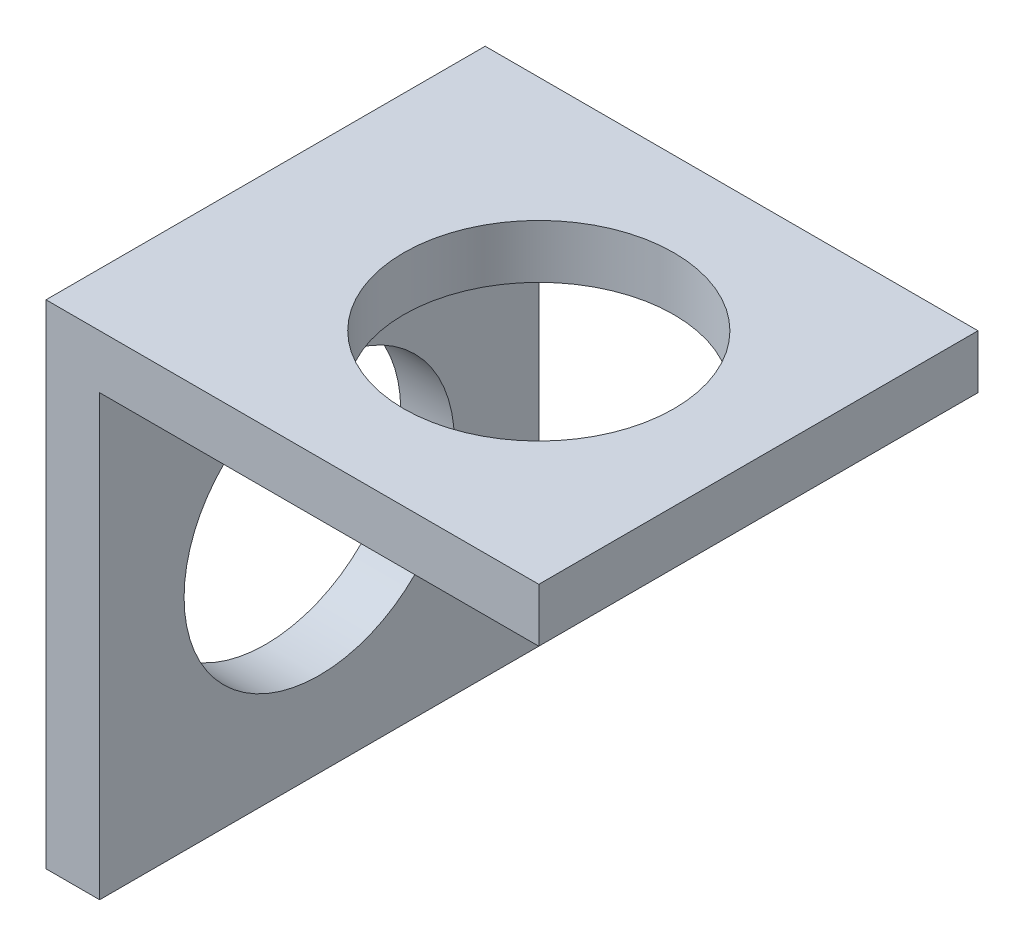
ISO-10303-21;
HEADER;
FILE_DESCRIPTION(('STEP AP214'),'2;1');
FILE_NAME('part.step','',(''),(''),'','','');
FILE_SCHEMA(('AUTOMOTIVE_DESIGN { 1 0 10303 214 1 1 1 1 }'));
ENDSEC;
DATA;
#1=APPLICATION_CONTEXT('core data for automotive mechanical design processes');
#2=APPLICATION_PROTOCOL_DEFINITION('international standard','automotive_design',2000,#1);
#3=PRODUCT_CONTEXT('',#1,'mechanical');
#4=PRODUCT('Part','Part','',(#3));
#5=PRODUCT_RELATED_PRODUCT_CATEGORY('part','',(#4));
#6=PRODUCT_DEFINITION_FORMATION('','',#4);
#7=PRODUCT_DEFINITION_CONTEXT('part definition',#1,'design');
#8=PRODUCT_DEFINITION('design','',#6,#7);
#9=PRODUCT_DEFINITION_SHAPE('','',#8);
#10=(LENGTH_UNIT() NAMED_UNIT(*) SI_UNIT(.MILLI.,.METRE.));
#11=(NAMED_UNIT(*) PLANE_ANGLE_UNIT() SI_UNIT($,.RADIAN.));
#12=(NAMED_UNIT(*) SI_UNIT($,.STERADIAN.) SOLID_ANGLE_UNIT());
#13=UNCERTAINTY_MEASURE_WITH_UNIT(LENGTH_MEASURE(1.E-05),#10,'distance_accuracy_value','');
#14=(GEOMETRIC_REPRESENTATION_CONTEXT(3) GLOBAL_UNCERTAINTY_ASSIGNED_CONTEXT((#13)) GLOBAL_UNIT_ASSIGNED_CONTEXT((#10,
#11,#12)) REPRESENTATION_CONTEXT('',''));
#15=CARTESIAN_POINT('',(0.,0.,0.));
#16=DIRECTION('',(0.,0.,1.));
#17=DIRECTION('',(1.,0.,0.));
#18=AXIS2_PLACEMENT_3D('',#15,#16,#17);
#19=CARTESIAN_POINT('',(0.,0.,52.));
#20=DIRECTION('',(0.,1.,0.));
#21=DIRECTION('',(0.,0.,1.));
#22=AXIS2_PLACEMENT_3D('',#19,#20,#21);
#23=PLANE('',#22);
#24=DIRECTION('',(1.,0.,0.));
#25=VECTOR('',#24,1.);
#26=CARTESIAN_POINT('',(0.,0.,0.));
#27=LINE('',#26,#25);
#28=CARTESIAN_POINT('',(0.,0.,0.));
#29=VERTEX_POINT('',#28);
#30=CARTESIAN_POINT('',(6.35,0.,0.));
#31=VERTEX_POINT('',#30);
#32=EDGE_CURVE('E123',#29,#31,#27,.T.);
#33=ORIENTED_EDGE('',*,*,#32,.T.);
#34=DIRECTION('',(0.,0.,-1.));
#35=VECTOR('',#34,1.);
#36=CARTESIAN_POINT('',(6.35,0.,52.));
#37=LINE('',#36,#35);
#38=CARTESIAN_POINT('',(6.35,0.,52.));
#39=VERTEX_POINT('',#38);
#40=EDGE_CURVE('E42',#39,#31,#37,.T.);
#41=ORIENTED_EDGE('',*,*,#40,.F.);
#42=DIRECTION('',(1.,0.,0.));
#43=VECTOR('',#42,1.);
#44=CARTESIAN_POINT('',(0.,0.,52.));
#45=LINE('',#44,#43);
#46=CARTESIAN_POINT('',(0.,0.,52.));
#47=VERTEX_POINT('',#46);
#48=EDGE_CURVE('E89',#47,#39,#45,.T.);
#49=ORIENTED_EDGE('',*,*,#48,.F.);
#50=DIRECTION('',(0.,0.,-1.));
#51=VECTOR('',#50,1.);
#52=CARTESIAN_POINT('',(0.,0.,52.));
#53=LINE('',#52,#51);
#54=EDGE_CURVE('E11',#47,#29,#53,.T.);
#55=ORIENTED_EDGE('',*,*,#54,.T.);
#56=EDGE_LOOP('',(#33,#41,#49,#55));
#57=FACE_BOUND('',#56,.T.);
#58=ADVANCED_FACE('F33',(#57),#23,.F.);
#59=CARTESIAN_POINT('',(6.35,0.,52.));
#60=DIRECTION('',(-1.,0.,0.));
#61=DIRECTION('',(0.,0.,1.));
#62=AXIS2_PLACEMENT_3D('',#59,#60,#61);
#63=PLANE('',#62);
#64=CARTESIAN_POINT('',(6.35,26.,26.));
#65=DIRECTION('',(1.,0.,0.));
#66=DIRECTION('',(0.,0.,-1.));
#67=AXIS2_PLACEMENT_3D('',#64,#65,#66);
#68=CIRCLE('',#67,16.);
#69=CARTESIAN_POINT('',(6.35,26.,10.));
#70=VERTEX_POINT('',#69);
#71=EDGE_CURVE('E146',#70,#70,#68,.T.);
#72=ORIENTED_EDGE('',*,*,#71,.F.);
#73=EDGE_LOOP('',(#72));
#74=FACE_BOUND('',#73,.T.);
#75=DIRECTION('',(0.,1.,0.));
#76=VECTOR('',#75,1.);
#77=CARTESIAN_POINT('',(6.35,0.,0.));
#78=LINE('',#77,#76);
#79=CARTESIAN_POINT('',(6.35,52.,0.));
#80=VERTEX_POINT('',#79);
#81=EDGE_CURVE('E125',#31,#80,#78,.T.);
#82=ORIENTED_EDGE('',*,*,#81,.T.);
#83=DIRECTION('',(0.,0.,-1.));
#84=VECTOR('',#83,1.);
#85=CARTESIAN_POINT('',(6.35,52.,52.));
#86=LINE('',#85,#84);
#87=CARTESIAN_POINT('',(6.35,52.,52.));
#88=VERTEX_POINT('',#87);
#89=EDGE_CURVE('E112',#88,#80,#86,.T.);
#90=ORIENTED_EDGE('',*,*,#89,.F.);
#91=DIRECTION('',(0.,1.,0.));
#92=VECTOR('',#91,1.);
#93=CARTESIAN_POINT('',(6.35,0.,52.));
#94=LINE('',#93,#92);
#95=EDGE_CURVE('E103',#39,#88,#94,.T.);
#96=ORIENTED_EDGE('',*,*,#95,.F.);
#97=ORIENTED_EDGE('',*,*,#40,.T.);
#98=EDGE_LOOP('',(#82,#90,#96,#97));
#99=FACE_BOUND('',#98,.T.);
#100=ADVANCED_FACE('F153',(#74,#99),#63,.F.);
#101=CARTESIAN_POINT('',(6.35,52.,52.));
#102=DIRECTION('',(0.,1.,0.));
#103=DIRECTION('',(0.,0.,1.));
#104=AXIS2_PLACEMENT_3D('',#101,#102,#103);
#105=PLANE('',#104);
#106=CARTESIAN_POINT('',(32.35,52.,26.));
#107=DIRECTION('',(0.,-1.,0.));
#108=DIRECTION('',(0.,0.,-1.));
#109=AXIS2_PLACEMENT_3D('',#106,#107,#108);
#110=CIRCLE('',#109,16.);
#111=CARTESIAN_POINT('',(32.35,52.,10.));
#112=VERTEX_POINT('',#111);
#113=EDGE_CURVE('E138',#112,#112,#110,.T.);
#114=ORIENTED_EDGE('',*,*,#113,.F.);
#115=EDGE_LOOP('',(#114));
#116=FACE_BOUND('',#115,.T.);
#117=DIRECTION('',(1.,0.,0.));
#118=VECTOR('',#117,1.);
#119=CARTESIAN_POINT('',(6.35,52.,0.));
#120=LINE('',#119,#118);
#121=CARTESIAN_POINT('',(58.35,52.,0.));
#122=VERTEX_POINT('',#121);
#123=EDGE_CURVE('E111',#80,#122,#120,.T.);
#124=ORIENTED_EDGE('',*,*,#123,.T.);
#125=DIRECTION('',(0.,0.,-1.));
#126=VECTOR('',#125,1.);
#127=CARTESIAN_POINT('',(58.35,52.,52.));
#128=LINE('',#127,#126);
#129=CARTESIAN_POINT('',(58.35,52.,52.));
#130=VERTEX_POINT('',#129);
#131=EDGE_CURVE('E108',#130,#122,#128,.T.);
#132=ORIENTED_EDGE('',*,*,#131,.F.);
#133=DIRECTION('',(1.,0.,0.));
#134=VECTOR('',#133,1.);
#135=CARTESIAN_POINT('',(6.35,52.,52.));
#136=LINE('',#135,#134);
#137=EDGE_CURVE('E97',#88,#130,#136,.T.);
#138=ORIENTED_EDGE('',*,*,#137,.F.);
#139=ORIENTED_EDGE('',*,*,#89,.T.);
#140=EDGE_LOOP('',(#124,#132,#138,#139));
#141=FACE_BOUND('',#140,.T.);
#142=ADVANCED_FACE('F109',(#116,#141),#105,.F.);
#143=CARTESIAN_POINT('',(58.35,52.,52.));
#144=DIRECTION('',(-1.,0.,0.));
#145=DIRECTION('',(0.,0.,1.));
#146=AXIS2_PLACEMENT_3D('',#143,#144,#145);
#147=PLANE('',#146);
#148=DIRECTION('',(0.,1.,0.));
#149=VECTOR('',#148,1.);
#150=CARTESIAN_POINT('',(58.35,52.,0.));
#151=LINE('',#150,#149);
#152=CARTESIAN_POINT('',(58.35,58.35,0.));
#153=VERTEX_POINT('',#152);
#154=EDGE_CURVE('E75',#122,#153,#151,.T.);
#155=ORIENTED_EDGE('',*,*,#154,.T.);
#156=DIRECTION('',(0.,0.,-1.));
#157=VECTOR('',#156,1.);
#158=CARTESIAN_POINT('',(58.35,58.35,52.));
#159=LINE('',#158,#157);
#160=CARTESIAN_POINT('',(58.35,58.35,52.));
#161=VERTEX_POINT('',#160);
#162=EDGE_CURVE('E113',#161,#153,#159,.T.);
#163=ORIENTED_EDGE('',*,*,#162,.F.);
#164=DIRECTION('',(0.,1.,0.));
#165=VECTOR('',#164,1.);
#166=CARTESIAN_POINT('',(58.35,52.,52.));
#167=LINE('',#166,#165);
#168=EDGE_CURVE('E101',#130,#161,#167,.T.);
#169=ORIENTED_EDGE('',*,*,#168,.F.);
#170=ORIENTED_EDGE('',*,*,#131,.T.);
#171=EDGE_LOOP('',(#155,#163,#169,#170));
#172=FACE_BOUND('',#171,.T.);
#173=ADVANCED_FACE('F115',(#172),#147,.F.);
#174=CARTESIAN_POINT('',(0.,58.35,52.));
#175=DIRECTION('',(0.,-1.,0.));
#176=DIRECTION('',(0.,0.,-1.));
#177=AXIS2_PLACEMENT_3D('',#174,#175,#176);
#178=PLANE('',#177);
#179=CARTESIAN_POINT('',(32.35,58.35,26.));
#180=DIRECTION('',(0.,-1.,0.));
#181=DIRECTION('',(0.,0.,-1.));
#182=AXIS2_PLACEMENT_3D('',#179,#180,#181);
#183=CIRCLE('',#182,16.);
#184=CARTESIAN_POINT('',(32.35,58.35,10.));
#185=VERTEX_POINT('',#184);
#186=EDGE_CURVE('E126',#185,#185,#183,.T.);
#187=ORIENTED_EDGE('',*,*,#186,.T.);
#188=EDGE_LOOP('',(#187));
#189=FACE_BOUND('',#188,.T.);
#190=DIRECTION('',(-1.,0.,0.));
#191=VECTOR('',#190,1.);
#192=CARTESIAN_POINT('',(0.,58.35,0.));
#193=LINE('',#192,#191);
#194=CARTESIAN_POINT('',(0.,58.35,0.));
#195=VERTEX_POINT('',#194);
#196=EDGE_CURVE('E82',#153,#195,#193,.T.);
#197=ORIENTED_EDGE('',*,*,#196,.T.);
#198=DIRECTION('',(0.,0.,-1.));
#199=VECTOR('',#198,1.);
#200=CARTESIAN_POINT('',(0.,58.35,52.));
#201=LINE('',#200,#199);
#202=CARTESIAN_POINT('',(0.,58.35,52.));
#203=VERTEX_POINT('',#202);
#204=EDGE_CURVE('E119',#203,#195,#201,.T.);
#205=ORIENTED_EDGE('',*,*,#204,.F.);
#206=DIRECTION('',(-1.,0.,0.));
#207=VECTOR('',#206,1.);
#208=CARTESIAN_POINT('',(0.,58.35,52.));
#209=LINE('',#208,#207);
#210=EDGE_CURVE('E117',#161,#203,#209,.T.);
#211=ORIENTED_EDGE('',*,*,#210,.F.);
#212=ORIENTED_EDGE('',*,*,#162,.T.);
#213=EDGE_LOOP('',(#197,#205,#211,#212));
#214=FACE_BOUND('',#213,.T.);
#215=ADVANCED_FACE('F158',(#189,#214),#178,.F.);
#216=CARTESIAN_POINT('',(0.,32.9730805379301,52.));
#217=DIRECTION('',(1.,0.,0.));
#218=DIRECTION('',(0.,0.,-1.));
#219=AXIS2_PLACEMENT_3D('',#216,#217,#218);
#220=PLANE('',#219);
#221=CARTESIAN_POINT('',(0.,26.,26.));
#222=DIRECTION('',(1.,0.,0.));
#223=DIRECTION('',(0.,0.,-1.));
#224=AXIS2_PLACEMENT_3D('',#221,#222,#223);
#225=CIRCLE('',#224,16.);
#226=CARTESIAN_POINT('',(0.,26.,10.));
#227=VERTEX_POINT('',#226);
#228=EDGE_CURVE('E36',#227,#227,#225,.T.);
#229=ORIENTED_EDGE('',*,*,#228,.T.);
#230=EDGE_LOOP('',(#229));
#231=FACE_BOUND('',#230,.T.);
#232=DIRECTION('',(0.,-1.,0.));
#233=VECTOR('',#232,1.);
#234=CARTESIAN_POINT('',(0.,32.9730805379301,0.));
#235=LINE('',#234,#233);
#236=EDGE_CURVE('E131',#195,#29,#235,.T.);
#237=ORIENTED_EDGE('',*,*,#236,.T.);
#238=ORIENTED_EDGE('',*,*,#54,.F.);
#239=DIRECTION('',(0.,-1.,0.));
#240=VECTOR('',#239,1.);
#241=CARTESIAN_POINT('',(0.,0.,52.));
#242=LINE('',#241,#240);
#243=EDGE_CURVE('E51',#203,#47,#242,.T.);
#244=ORIENTED_EDGE('',*,*,#243,.F.);
#245=ORIENTED_EDGE('',*,*,#204,.T.);
#246=EDGE_LOOP('',(#237,#238,#244,#245));
#247=FACE_BOUND('',#246,.T.);
#248=ADVANCED_FACE('F157',(#231,#247),#220,.F.);
#249=CARTESIAN_POINT('',(0.,0.,52.));
#250=DIRECTION('',(0.,0.,-1.));
#251=DIRECTION('',(-1.,0.,0.));
#252=AXIS2_PLACEMENT_3D('',#249,#250,#251);
#253=PLANE('',#252);
#254=ORIENTED_EDGE('',*,*,#243,.T.);
#255=ORIENTED_EDGE('',*,*,#48,.T.);
#256=ORIENTED_EDGE('',*,*,#95,.T.);
#257=ORIENTED_EDGE('',*,*,#137,.T.);
#258=ORIENTED_EDGE('',*,*,#168,.T.);
#259=ORIENTED_EDGE('',*,*,#210,.T.);
#260=EDGE_LOOP('',(#254,#255,#256,#257,#258,#259));
#261=FACE_BOUND('',#260,.T.);
#262=ADVANCED_FACE('F99',(#261),#253,.F.);
#263=CARTESIAN_POINT('',(0.,0.,0.));
#264=DIRECTION('',(0.,0.,-1.));
#265=DIRECTION('',(-1.,0.,0.));
#266=AXIS2_PLACEMENT_3D('',#263,#264,#265);
#267=PLANE('',#266);
#268=ORIENTED_EDGE('',*,*,#32,.F.);
#269=ORIENTED_EDGE('',*,*,#236,.F.);
#270=ORIENTED_EDGE('',*,*,#196,.F.);
#271=ORIENTED_EDGE('',*,*,#154,.F.);
#272=ORIENTED_EDGE('',*,*,#123,.F.);
#273=ORIENTED_EDGE('',*,*,#81,.F.);
#274=EDGE_LOOP('',(#268,#269,#270,#271,#272,#273));
#275=FACE_BOUND('',#274,.T.);
#276=ADVANCED_FACE('F155',(#275),#267,.T.);
#277=CARTESIAN_POINT('',(32.35,104.,26.));
#278=DIRECTION('',(0.,-1.,0.));
#279=DIRECTION('',(0.,0.,-1.));
#280=AXIS2_PLACEMENT_3D('',#277,#278,#279);
#281=CYLINDRICAL_SURFACE('',#280,16.);
#282=ORIENTED_EDGE('',*,*,#113,.T.);
#283=EDGE_LOOP('',(#282));
#284=FACE_BOUND('',#283,.T.);
#285=ORIENTED_EDGE('',*,*,#186,.F.);
#286=EDGE_LOOP('',(#285));
#287=FACE_BOUND('',#286,.T.);
#288=ADVANCED_FACE('F184',(#284,#287),#281,.F.);
#289=CARTESIAN_POINT('',(-45.65,26.,26.));
#290=DIRECTION('',(1.,0.,0.));
#291=DIRECTION('',(0.,0.,-1.));
#292=AXIS2_PLACEMENT_3D('',#289,#290,#291);
#293=CYLINDRICAL_SURFACE('',#292,16.);
#294=ORIENTED_EDGE('',*,*,#71,.T.);
#295=EDGE_LOOP('',(#294));
#296=FACE_BOUND('',#295,.T.);
#297=ORIENTED_EDGE('',*,*,#228,.F.);
#298=EDGE_LOOP('',(#297));
#299=FACE_BOUND('',#298,.T.);
#300=ADVANCED_FACE('F181',(#296,#299),#293,.F.);
#301=CLOSED_SHELL('',(#58,#100,#142,#173,#215,#248,#262,#276,#288,#300));
#302=MANIFOLD_SOLID_BREP('B2',#301);
#303=ADVANCED_BREP_SHAPE_REPRESENTATION('',(#18,#302),#14);
#304=SHAPE_DEFINITION_REPRESENTATION(#9,#303);
ENDSEC;
END-ISO-10303-21;
